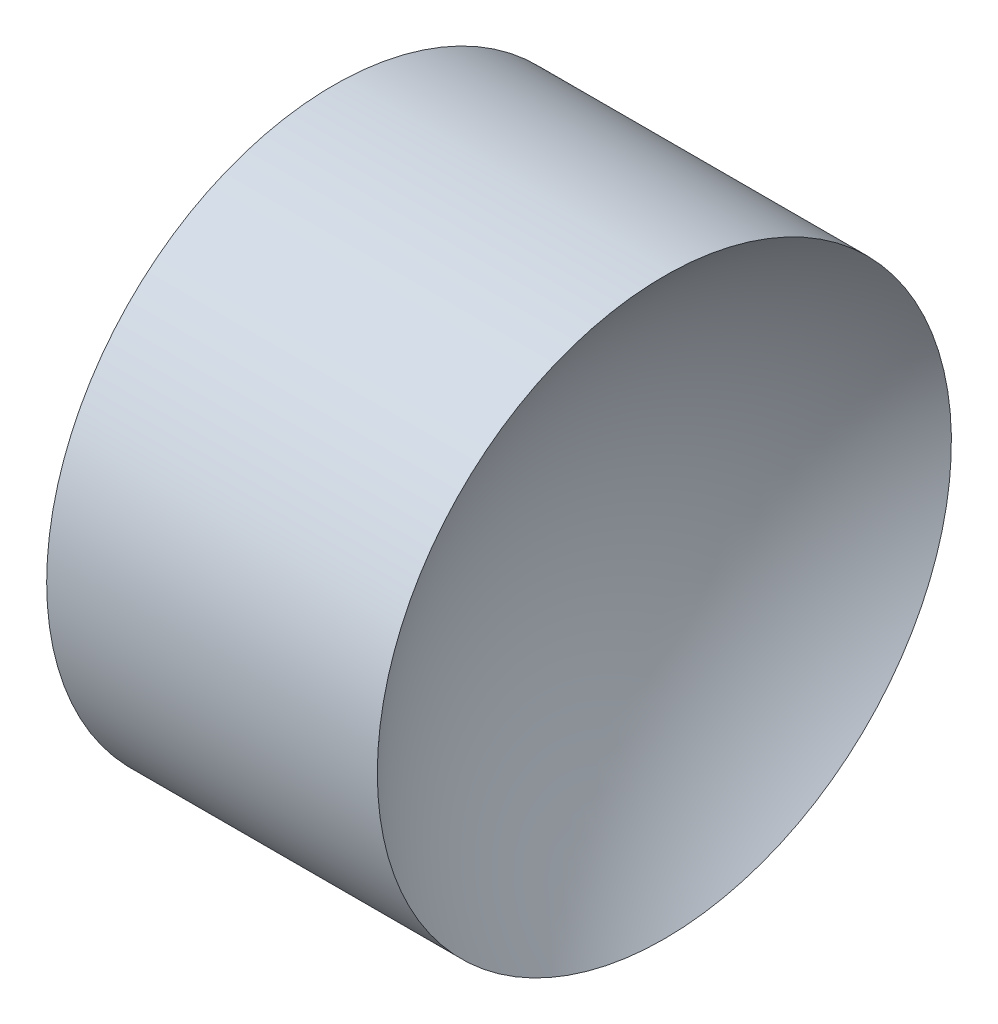
ISO-10303-21;
HEADER;
FILE_DESCRIPTION(('STEP AP214'),'2;1');
FILE_NAME('part.step','',(''),(''),'','','');
FILE_SCHEMA(('AUTOMOTIVE_DESIGN { 1 0 10303 214 1 1 1 1 }'));
ENDSEC;
DATA;
#1=APPLICATION_CONTEXT('core data for automotive mechanical design processes');
#2=APPLICATION_PROTOCOL_DEFINITION('international standard','automotive_design',2000,#1);
#3=PRODUCT_CONTEXT('',#1,'mechanical');
#4=PRODUCT('Part','Part','',(#3));
#5=PRODUCT_RELATED_PRODUCT_CATEGORY('part','',(#4));
#6=PRODUCT_DEFINITION_FORMATION('','',#4);
#7=PRODUCT_DEFINITION_CONTEXT('part definition',#1,'design');
#8=PRODUCT_DEFINITION('design','',#6,#7);
#9=PRODUCT_DEFINITION_SHAPE('','',#8);
#10=(LENGTH_UNIT() NAMED_UNIT(*) SI_UNIT(.MILLI.,.METRE.));
#11=(NAMED_UNIT(*) PLANE_ANGLE_UNIT() SI_UNIT($,.RADIAN.));
#12=(NAMED_UNIT(*) SI_UNIT($,.STERADIAN.) SOLID_ANGLE_UNIT());
#13=UNCERTAINTY_MEASURE_WITH_UNIT(LENGTH_MEASURE(1.E-05),#10,'distance_accuracy_value','');
#14=(GEOMETRIC_REPRESENTATION_CONTEXT(3) GLOBAL_UNCERTAINTY_ASSIGNED_CONTEXT((#13)) GLOBAL_UNIT_ASSIGNED_CONTEXT((#10,
#11,#12)) REPRESENTATION_CONTEXT('',''));
#15=CARTESIAN_POINT('',(0.,0.,0.));
#16=DIRECTION('',(0.,0.,1.));
#17=DIRECTION('',(1.,0.,0.));
#18=AXIS2_PLACEMENT_3D('',#15,#16,#17);
#19=CARTESIAN_POINT('',(15.470595084783,6.51556304570152,0.));
#20=DIRECTION('',(-1.,0.,0.));
#21=DIRECTION('',(0.,-1.,0.));
#22=AXIS2_PLACEMENT_3D('',#19,#20,#21);
#23=SPHERICAL_SURFACE('',#22,2.89);
#24=CARTESIAN_POINT('',(13.3844263475999,6.51556304570152,0.));
#25=DIRECTION('',(-1.,0.,0.));
#26=DIRECTION('',(0.,0.,1.));
#27=AXIS2_PLACEMENT_3D('',#24,#25,#26);
#28=CIRCLE('',#27,2.);
#29=CARTESIAN_POINT('',(13.3844263475999,6.51556304570152,2.));
#30=VERTEX_POINT('',#29);
#31=EDGE_CURVE('E10',#30,#30,#28,.T.);
#32=ORIENTED_EDGE('',*,*,#31,.F.);
#33=EDGE_LOOP('',(#32));
#34=FACE_BOUND('',#33,.T.);
#35=ADVANCED_FACE('F35',(#34),#23,.F.);
#36=CARTESIAN_POINT('',(10.5782359612221,6.51556304570152,0.));
#37=DIRECTION('',(-1.,0.,0.));
#38=DIRECTION('',(0.,0.,1.));
#39=AXIS2_PLACEMENT_3D('',#36,#37,#38);
#40=CYLINDRICAL_SURFACE('',#39,2.);
#41=CARTESIAN_POINT('',(11.080595084783,6.51556304570152,0.));
#42=DIRECTION('',(-1.,0.,0.));
#43=DIRECTION('',(0.,0.,1.));
#44=AXIS2_PLACEMENT_3D('',#41,#42,#43);
#45=CIRCLE('',#44,2.);
#46=CARTESIAN_POINT('',(11.080595084783,6.51556304570152,2.));
#47=VERTEX_POINT('',#46);
#48=EDGE_CURVE('E41',#47,#47,#45,.T.);
#49=ORIENTED_EDGE('',*,*,#48,.F.);
#50=EDGE_LOOP('',(#49));
#51=FACE_BOUND('',#50,.T.);
#52=ORIENTED_EDGE('',*,*,#31,.T.);
#53=EDGE_LOOP('',(#52));
#54=FACE_BOUND('',#53,.T.);
#55=ADVANCED_FACE('F49',(#51,#54),#40,.T.);
#56=CARTESIAN_POINT('',(11.080595084783,6.51556304570152,0.));
#57=DIRECTION('',(1.,0.,0.));
#58=DIRECTION('',(0.,0.,-1.));
#59=AXIS2_PLACEMENT_3D('',#56,#57,#58);
#60=PLANE('',#59);
#61=ORIENTED_EDGE('',*,*,#48,.T.);
#62=EDGE_LOOP('',(#61));
#63=FACE_BOUND('',#62,.T.);
#64=ADVANCED_FACE('F47',(#63),#60,.F.);
#65=CLOSED_SHELL('',(#35,#55,#64));
#66=MANIFOLD_SOLID_BREP('B2',#65);
#67=ADVANCED_BREP_SHAPE_REPRESENTATION('',(#18,#66),#14);
#68=SHAPE_DEFINITION_REPRESENTATION(#9,#67);
ENDSEC;
END-ISO-10303-21;
